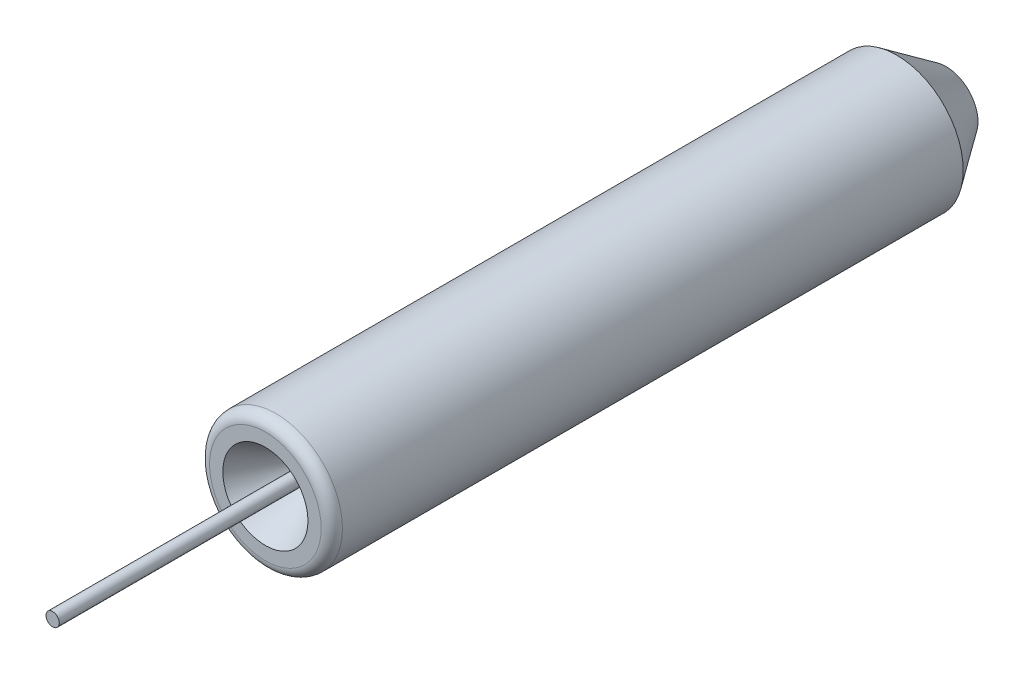
ISO-10303-21;
HEADER;
FILE_DESCRIPTION(('STEP AP214'),'2;1');
FILE_NAME('part.step','',(''),(''),'','','');
FILE_SCHEMA(('AUTOMOTIVE_DESIGN { 1 0 10303 214 1 1 1 1 }'));
ENDSEC;
DATA;
#1=APPLICATION_CONTEXT('core data for automotive mechanical design processes');
#2=APPLICATION_PROTOCOL_DEFINITION('international standard','automotive_design',2000,#1);
#3=PRODUCT_CONTEXT('',#1,'mechanical');
#4=PRODUCT('Part','Part','',(#3));
#5=PRODUCT_RELATED_PRODUCT_CATEGORY('part','',(#4));
#6=PRODUCT_DEFINITION_FORMATION('','',#4);
#7=PRODUCT_DEFINITION_CONTEXT('part definition',#1,'design');
#8=PRODUCT_DEFINITION('design','',#6,#7);
#9=PRODUCT_DEFINITION_SHAPE('','',#8);
#10=(LENGTH_UNIT() NAMED_UNIT(*) SI_UNIT(.MILLI.,.METRE.));
#11=(NAMED_UNIT(*) PLANE_ANGLE_UNIT() SI_UNIT($,.RADIAN.));
#12=(NAMED_UNIT(*) SI_UNIT($,.STERADIAN.) SOLID_ANGLE_UNIT());
#13=UNCERTAINTY_MEASURE_WITH_UNIT(LENGTH_MEASURE(1.E-05),#10,'distance_accuracy_value','');
#14=(GEOMETRIC_REPRESENTATION_CONTEXT(3) GLOBAL_UNCERTAINTY_ASSIGNED_CONTEXT((#13)) GLOBAL_UNIT_ASSIGNED_CONTEXT((#10,
#11,#12)) REPRESENTATION_CONTEXT('',''));
#15=CARTESIAN_POINT('',(0.,0.,0.));
#16=DIRECTION('',(0.,0.,1.));
#17=DIRECTION('',(1.,0.,0.));
#18=AXIS2_PLACEMENT_3D('',#15,#16,#17);
#19=CARTESIAN_POINT('',(0.,0.,-6.4));
#20=DIRECTION('',(0.,0.,1.));
#21=DIRECTION('',(1.,0.,0.));
#22=AXIS2_PLACEMENT_3D('',#19,#20,#21);
#23=CYLINDRICAL_SURFACE('',#22,0.0625);
#24=CARTESIAN_POINT('',(0.,0.,-6.4));
#25=DIRECTION('',(0.,0.,1.));
#26=DIRECTION('',(1.,0.,0.));
#27=AXIS2_PLACEMENT_3D('',#24,#25,#26);
#28=CIRCLE('',#27,0.0625);
#29=CARTESIAN_POINT('',(0.0625,0.,-6.4));
#30=VERTEX_POINT('',#29);
#31=EDGE_CURVE('P0_E10',#30,#30,#28,.T.);
#32=ORIENTED_EDGE('',*,*,#31,.T.);
#33=EDGE_LOOP('',(#32));
#34=FACE_BOUND('',#33,.T.);
#35=CARTESIAN_POINT('',(0.,0.,2.));
#36=DIRECTION('',(0.,0.,1.));
#37=DIRECTION('',(1.,0.,0.));
#38=AXIS2_PLACEMENT_3D('',#35,#36,#37);
#39=CIRCLE('',#38,0.0625);
#40=CARTESIAN_POINT('',(0.0625,0.,2.));
#41=VERTEX_POINT('',#40);
#42=EDGE_CURVE('P0_E17',#41,#41,#39,.T.);
#43=ORIENTED_EDGE('',*,*,#42,.F.);
#44=EDGE_LOOP('',(#43));
#45=FACE_BOUND('',#44,.T.);
#46=ADVANCED_FACE('P0_F14',(#34,#45),#23,.T.);
#47=CARTESIAN_POINT('',(0.,0.,-6.4));
#48=DIRECTION('',(0.,0.,1.));
#49=DIRECTION('',(1.,0.,0.));
#50=AXIS2_PLACEMENT_3D('',#47,#48,#49);
#51=PLANE('',#50);
#52=ORIENTED_EDGE('',*,*,#31,.F.);
#53=EDGE_LOOP('',(#52));
#54=FACE_BOUND('',#53,.T.);
#55=ADVANCED_FACE('P0_F29',(#54),#51,.F.);
#56=CARTESIAN_POINT('',(0.,0.,2.));
#57=DIRECTION('',(0.,0.,1.));
#58=DIRECTION('',(1.,0.,0.));
#59=AXIS2_PLACEMENT_3D('',#56,#57,#58);
#60=PLANE('',#59);
#61=ORIENTED_EDGE('',*,*,#42,.T.);
#62=EDGE_LOOP('',(#61));
#63=FACE_BOUND('',#62,.T.);
#64=ADVANCED_FACE('P0_F26',(#63),#60,.T.);
#65=CLOSED_SHELL('',(#46,#55,#64));
#66=MANIFOLD_SOLID_BREP('P0_B1',#65);
#67=CARTESIAN_POINT('',(0.,0.,-6.4));
#68=DIRECTION('',(0.,0.,1.));
#69=DIRECTION('',(1.,0.,0.));
#70=AXIS2_PLACEMENT_3D('',#67,#68,#69);
#71=CYLINDRICAL_SURFACE('',#70,0.6245);
#72=CARTESIAN_POINT('',(0.,0.,-0.1));
#73=DIRECTION('',(0.,0.,1.));
#74=DIRECTION('',(1.,0.,0.));
#75=AXIS2_PLACEMENT_3D('',#72,#73,#74);
#76=CIRCLE('',#75,0.6245);
#77=CARTESIAN_POINT('',(0.6245,0.,-0.1));
#78=VERTEX_POINT('',#77);
#79=EDGE_CURVE('P1_E9',#78,#78,#76,.F.);
#80=ORIENTED_EDGE('',*,*,#79,.T.);
#81=EDGE_LOOP('',(#80));
#82=FACE_BOUND('',#81,.T.);
#83=CARTESIAN_POINT('',(0.,0.,-5.93585189780881));
#84=DIRECTION('',(0.,0.,1.));
#85=DIRECTION('',(1.,0.,0.));
#86=AXIS2_PLACEMENT_3D('',#83,#84,#85);
#87=CIRCLE('',#86,0.6245);
#88=CARTESIAN_POINT('',(0.6245,0.,-5.93585189780881));
#89=VERTEX_POINT('',#88);
#90=EDGE_CURVE('P1_E28',#89,#89,#87,.T.);
#91=ORIENTED_EDGE('',*,*,#90,.T.);
#92=EDGE_LOOP('',(#91));
#93=FACE_BOUND('',#92,.T.);
#94=ADVANCED_FACE('P1_F13',(#82,#93),#71,.T.);
#95=CARTESIAN_POINT('',(0.,0.,-6.4));
#96=DIRECTION('',(0.,0.,1.));
#97=DIRECTION('',(1.,0.,0.));
#98=AXIS2_PLACEMENT_3D('',#95,#96,#97);
#99=PLANE('',#98);
#100=CARTESIAN_POINT('',(0.,0.,-6.4));
#101=DIRECTION('',(0.,0.,1.));
#102=DIRECTION('',(1.,0.,0.));
#103=AXIS2_PLACEMENT_3D('',#100,#101,#102);
#104=CIRCLE('',#103,0.299499999999999);
#105=CARTESIAN_POINT('',(0.299499999999999,0.,-6.4));
#106=VERTEX_POINT('',#105);
#107=EDGE_CURVE('P1_E24',#106,#106,#104,.F.);
#108=ORIENTED_EDGE('',*,*,#107,.T.);
#109=EDGE_LOOP('',(#108));
#110=FACE_BOUND('',#109,.T.);
#111=CARTESIAN_POINT('',(0.,0.,-6.4));
#112=DIRECTION('',(0.,0.,-1.));
#113=DIRECTION('',(-1.,0.,0.));
#114=AXIS2_PLACEMENT_3D('',#111,#112,#113);
#115=CIRCLE('',#114,0.063);
#116=CARTESIAN_POINT('',(-0.063,0.,-6.4));
#117=VERTEX_POINT('',#116);
#118=EDGE_CURVE('P1_E42',#117,#117,#115,.T.);
#119=ORIENTED_EDGE('',*,*,#118,.F.);
#120=EDGE_LOOP('',(#119));
#121=FACE_BOUND('',#120,.T.);
#122=ADVANCED_FACE('P1_F48',(#110,#121),#99,.F.);
#123=CARTESIAN_POINT('',(0.,0.,0.));
#124=DIRECTION('',(0.,0.,1.));
#125=DIRECTION('',(1.,0.,0.));
#126=AXIS2_PLACEMENT_3D('',#123,#124,#125);
#127=PLANE('',#126);
#128=CARTESIAN_POINT('',(0.,0.,0.));
#129=DIRECTION('',(0.,0.,1.));
#130=DIRECTION('',(1.,0.,0.));
#131=AXIS2_PLACEMENT_3D('',#128,#129,#130);
#132=CIRCLE('',#131,0.5245);
#133=CARTESIAN_POINT('',(0.5245,0.,0.));
#134=VERTEX_POINT('',#133);
#135=EDGE_CURVE('P1_E20',#134,#134,#132,.T.);
#136=ORIENTED_EDGE('',*,*,#135,.T.);
#137=EDGE_LOOP('',(#136));
#138=FACE_BOUND('',#137,.T.);
#139=CARTESIAN_POINT('',(0.,0.,0.));
#140=DIRECTION('',(0.,0.,-1.));
#141=DIRECTION('',(-1.,0.,0.));
#142=AXIS2_PLACEMENT_3D('',#139,#140,#141);
#143=CIRCLE('',#142,0.4);
#144=CARTESIAN_POINT('',(-0.4,0.,0.));
#145=VERTEX_POINT('',#144);
#146=EDGE_CURVE('P1_E33',#145,#145,#143,.T.);
#147=ORIENTED_EDGE('',*,*,#146,.T.);
#148=EDGE_LOOP('',(#147));
#149=FACE_BOUND('',#148,.T.);
#150=ADVANCED_FACE('P1_F50',(#138,#149),#127,.T.);
#151=CARTESIAN_POINT('',(0.,0.,-0.537290960636936));
#152=DIRECTION('',(0.,0.,1.));
#153=DIRECTION('',(1.,0.,0.));
#154=AXIS2_PLACEMENT_3D('',#151,#152,#153);
#155=CONICAL_SURFACE('',#154,0.0897949192431117,0.5235987755983);
#156=ORIENTED_EDGE('',*,*,#146,.F.);
#157=EDGE_LOOP('',(#156));
#158=FACE_BOUND('',#157,.T.);
#159=CARTESIAN_POINT('',(0.,0.,-0.537290960636936));
#160=DIRECTION('',(0.,0.,-1.));
#161=DIRECTION('',(-1.,0.,0.));
#162=AXIS2_PLACEMENT_3D('',#159,#160,#161);
#163=CIRCLE('',#162,0.0897949192431117);
#164=CARTESIAN_POINT('',(-0.0897949192431117,0.,-0.537290960636936));
#165=VERTEX_POINT('',#164);
#166=EDGE_CURVE('P1_E36',#165,#165,#163,.T.);
#167=ORIENTED_EDGE('',*,*,#166,.T.);
#168=EDGE_LOOP('',(#167));
#169=FACE_BOUND('',#168,.T.);
#170=ADVANCED_FACE('P1_F58',(#158,#169),#155,.F.);
#171=CARTESIAN_POINT('',(0.,0.,-0.637290960636936));
#172=DIRECTION('',(0.,0.,-1.));
#173=DIRECTION('',(-1.,0.,0.));
#174=AXIS2_PLACEMENT_3D('',#171,#172,#173);
#175=TOROIDAL_SURFACE('',#174,0.262999999999999,0.2);
#176=ORIENTED_EDGE('',*,*,#166,.F.);
#177=EDGE_LOOP('',(#176));
#178=FACE_BOUND('',#177,.T.);
#179=CARTESIAN_POINT('',(0.,0.,-0.637290960636937));
#180=DIRECTION('',(0.,0.,-1.));
#181=DIRECTION('',(-1.,0.,0.));
#182=AXIS2_PLACEMENT_3D('',#179,#180,#181);
#183=CIRCLE('',#182,0.0629999999999993);
#184=CARTESIAN_POINT('',(-0.0629999999999993,0.,-0.637290960636937));
#185=VERTEX_POINT('',#184);
#186=EDGE_CURVE('P1_E39',#185,#185,#183,.T.);
#187=ORIENTED_EDGE('',*,*,#186,.T.);
#188=EDGE_LOOP('',(#187));
#189=FACE_BOUND('',#188,.T.);
#190=ADVANCED_FACE('P1_F71',(#178,#189),#175,.T.);
#191=CARTESIAN_POINT('',(0.,0.,-13.136975719544));
#192=DIRECTION('',(0.,0.,-1.));
#193=DIRECTION('',(-1.,0.,0.));
#194=AXIS2_PLACEMENT_3D('',#191,#192,#193);
#195=CYLINDRICAL_SURFACE('',#194,0.0629999999999997);
#196=ORIENTED_EDGE('',*,*,#186,.F.);
#197=EDGE_LOOP('',(#196));
#198=FACE_BOUND('',#197,.T.);
#199=ORIENTED_EDGE('',*,*,#118,.T.);
#200=EDGE_LOOP('',(#199));
#201=FACE_BOUND('',#200,.T.);
#202=ADVANCED_FACE('P1_F46',(#198,#201),#195,.F.);
#203=CARTESIAN_POINT('',(0.,0.,-5.93585189780881));
#204=DIRECTION('',(0.,0.,1.));
#205=DIRECTION('',(1.,0.,0.));
#206=AXIS2_PLACEMENT_3D('',#203,#204,#205);
#207=CONICAL_SURFACE('',#206,0.6245,0.610865238198017);
#208=ORIENTED_EDGE('',*,*,#107,.F.);
#209=EDGE_LOOP('',(#208));
#210=FACE_BOUND('',#209,.T.);
#211=ORIENTED_EDGE('',*,*,#90,.F.);
#212=EDGE_LOOP('',(#211));
#213=FACE_BOUND('',#212,.T.);
#214=ADVANCED_FACE('P1_F63',(#210,#213),#207,.T.);
#215=CARTESIAN_POINT('',(0.,0.,-0.1));
#216=DIRECTION('',(0.,0.,1.));
#217=DIRECTION('',(1.,0.,0.));
#218=AXIS2_PLACEMENT_3D('',#215,#216,#217);
#219=TOROIDAL_SURFACE('',#218,0.5245,0.1);
#220=ORIENTED_EDGE('',*,*,#79,.F.);
#221=EDGE_LOOP('',(#220));
#222=FACE_BOUND('',#221,.T.);
#223=ORIENTED_EDGE('',*,*,#135,.F.);
#224=EDGE_LOOP('',(#223));
#225=FACE_BOUND('',#224,.T.);
#226=ADVANCED_FACE('P1_F15',(#222,#225),#219,.T.);
#227=CLOSED_SHELL('',(#94,#122,#150,#170,#190,#202,#214,#226));
#228=MANIFOLD_SOLID_BREP('P1_B1',#227);
#229=ADVANCED_BREP_SHAPE_REPRESENTATION('',(#18,#66,#228),#14);
#230=SHAPE_DEFINITION_REPRESENTATION(#9,#229);
ENDSEC;
END-ISO-10303-21;
